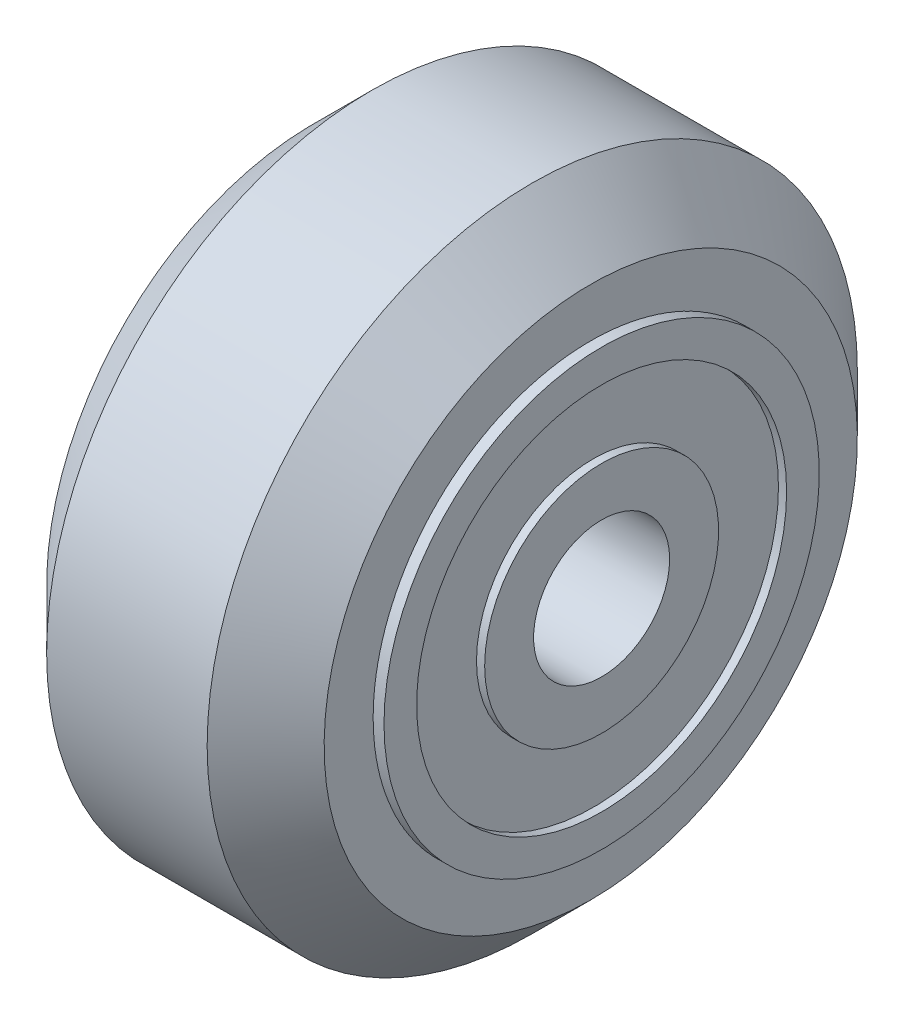
ISO-10303-21;
HEADER;
FILE_DESCRIPTION(('STEP AP214'),'2;1');
FILE_NAME('part.step','',(''),(''),'','','');
FILE_SCHEMA(('AUTOMOTIVE_DESIGN { 1 0 10303 214 1 1 1 1 }'));
ENDSEC;
DATA;
#1=APPLICATION_CONTEXT('core data for automotive mechanical design processes');
#2=APPLICATION_PROTOCOL_DEFINITION('international standard','automotive_design',2000,#1);
#3=PRODUCT_CONTEXT('',#1,'mechanical');
#4=PRODUCT('Part','Part','',(#3));
#5=PRODUCT_RELATED_PRODUCT_CATEGORY('part','',(#4));
#6=PRODUCT_DEFINITION_FORMATION('','',#4);
#7=PRODUCT_DEFINITION_CONTEXT('part definition',#1,'design');
#8=PRODUCT_DEFINITION('design','',#6,#7);
#9=PRODUCT_DEFINITION_SHAPE('','',#8);
#10=(LENGTH_UNIT() NAMED_UNIT(*) SI_UNIT(.MILLI.,.METRE.));
#11=(NAMED_UNIT(*) PLANE_ANGLE_UNIT() SI_UNIT($,.RADIAN.));
#12=(NAMED_UNIT(*) SI_UNIT($,.STERADIAN.) SOLID_ANGLE_UNIT());
#13=UNCERTAINTY_MEASURE_WITH_UNIT(LENGTH_MEASURE(1.E-05),#10,'distance_accuracy_value','');
#14=(GEOMETRIC_REPRESENTATION_CONTEXT(3) GLOBAL_UNCERTAINTY_ASSIGNED_CONTEXT((#13)) GLOBAL_UNIT_ASSIGNED_CONTEXT((#10,
#11,#12)) REPRESENTATION_CONTEXT('',''));
#15=CARTESIAN_POINT('',(0.,0.,0.));
#16=DIRECTION('',(0.,0.,1.));
#17=DIRECTION('',(1.,0.,0.));
#18=AXIS2_PLACEMENT_3D('',#15,#16,#17);
#19=CARTESIAN_POINT('',(-25.789895634528,-254.731355935514,43.4088020931475));
#20=DIRECTION('',(1.,0.,0.));
#21=DIRECTION('',(0.,0.,-1.));
#22=AXIS2_PLACEMENT_3D('',#19,#20,#21);
#23=CYLINDRICAL_SURFACE('',#22,7.00000000000003);
#24=CARTESIAN_POINT('',(-26.289895634528,-254.731355935514,43.4088020931475));
#25=DIRECTION('',(1.,0.,0.));
#26=DIRECTION('',(0.,0.,-1.));
#27=AXIS2_PLACEMENT_3D('',#24,#25,#26);
#28=CIRCLE('',#27,7.00000000000003);
#29=CARTESIAN_POINT('',(-26.289895634528,-254.731355935514,36.4088020931475));
#30=VERTEX_POINT('',#29);
#31=EDGE_CURVE('E89',#30,#30,#28,.T.);
#32=ORIENTED_EDGE('',*,*,#31,.F.);
#33=EDGE_LOOP('',(#32));
#34=FACE_BOUND('',#33,.T.);
#35=CARTESIAN_POINT('',(-25.289895634528,-254.731355935514,43.4088020931475));
#36=DIRECTION('',(1.,0.,0.));
#37=DIRECTION('',(0.,0.,-1.));
#38=AXIS2_PLACEMENT_3D('',#35,#36,#37);
#39=CIRCLE('',#38,7.00000000000003);
#40=CARTESIAN_POINT('',(-25.289895634528,-254.731355935514,36.4088020931475));
#41=VERTEX_POINT('',#40);
#42=EDGE_CURVE('E51',#41,#41,#39,.F.);
#43=ORIENTED_EDGE('',*,*,#42,.F.);
#44=EDGE_LOOP('',(#43));
#45=FACE_BOUND('',#44,.T.);
#46=ADVANCED_FACE('F48',(#34,#45),#23,.F.);
#47=CARTESIAN_POINT('',(-25.289895634528,-262.731355935514,35.4088020931475));
#48=DIRECTION('',(1.,0.,0.));
#49=DIRECTION('',(0.,0.,-1.));
#50=AXIS2_PLACEMENT_3D('',#47,#48,#49);
#51=PLANE('',#50);
#52=ORIENTED_EDGE('',*,*,#42,.T.);
#53=EDGE_LOOP('',(#52));
#54=FACE_BOUND('',#53,.T.);
#55=CARTESIAN_POINT('',(-25.289895634528,-254.731355935514,43.4088020931475));
#56=DIRECTION('',(1.,0.,0.));
#57=DIRECTION('',(0.,0.,-1.));
#58=AXIS2_PLACEMENT_3D('',#55,#56,#57);
#59=CIRCLE('',#58,8.00000000000001);
#60=CARTESIAN_POINT('',(-25.289895634528,-254.731355935514,35.4088020931475));
#61=VERTEX_POINT('',#60);
#62=EDGE_CURVE('E86',#61,#61,#59,.T.);
#63=ORIENTED_EDGE('',*,*,#62,.T.);
#64=EDGE_LOOP('',(#63));
#65=FACE_BOUND('',#64,.T.);
#66=ADVANCED_FACE('F98',(#54,#65),#51,.T.);
#67=CARTESIAN_POINT('',(-26.289895634528,-246.731355935514,35.4088020931475));
#68=DIRECTION('',(-1.,0.,0.));
#69=DIRECTION('',(0.,0.,1.));
#70=AXIS2_PLACEMENT_3D('',#67,#68,#69);
#71=PLANE('',#70);
#72=ORIENTED_EDGE('',*,*,#31,.T.);
#73=EDGE_LOOP('',(#72));
#74=FACE_BOUND('',#73,.T.);
#75=CARTESIAN_POINT('',(-26.289895634528,-254.731355935514,43.4088020931475));
#76=DIRECTION('',(1.,0.,0.));
#77=DIRECTION('',(0.,0.,-1.));
#78=AXIS2_PLACEMENT_3D('',#75,#76,#77);
#79=CIRCLE('',#78,8.00000000000001);
#80=CARTESIAN_POINT('',(-26.289895634528,-254.731355935514,35.4088020931475));
#81=VERTEX_POINT('',#80);
#82=EDGE_CURVE('E82',#81,#81,#79,.F.);
#83=ORIENTED_EDGE('',*,*,#82,.T.);
#84=EDGE_LOOP('',(#83));
#85=FACE_BOUND('',#84,.T.);
#86=ADVANCED_FACE('F106',(#74,#85),#71,.T.);
#87=CARTESIAN_POINT('',(-22.989895634528,-254.731355935514,43.4088020931475));
#88=DIRECTION('',(1.,0.,0.));
#89=DIRECTION('',(0.,0.,-1.));
#90=AXIS2_PLACEMENT_3D('',#87,#88,#89);
#91=CYLINDRICAL_SURFACE('',#90,8.00000000000001);
#92=ORIENTED_EDGE('',*,*,#62,.F.);
#93=EDGE_LOOP('',(#92));
#94=FACE_BOUND('',#93,.T.);
#95=CARTESIAN_POINT('',(-20.689895634528,-254.731355935514,43.4088020931475));
#96=DIRECTION('',(1.,0.,0.));
#97=DIRECTION('',(0.,0.,-1.));
#98=AXIS2_PLACEMENT_3D('',#95,#96,#97);
#99=CIRCLE('',#98,8.00000000000001);
#100=CARTESIAN_POINT('',(-20.689895634528,-254.731355935514,35.4088020931475));
#101=VERTEX_POINT('',#100);
#102=EDGE_CURVE('E78',#101,#101,#99,.F.);
#103=ORIENTED_EDGE('',*,*,#102,.F.);
#104=EDGE_LOOP('',(#103));
#105=FACE_BOUND('',#104,.T.);
#106=ADVANCED_FACE('F133',(#94,#105),#91,.F.);
#107=CARTESIAN_POINT('',(-28.589895634528,-254.731355935514,43.4088020931475));
#108=DIRECTION('',(1.,0.,0.));
#109=DIRECTION('',(0.,0.,-1.));
#110=AXIS2_PLACEMENT_3D('',#107,#108,#109);
#111=CYLINDRICAL_SURFACE('',#110,8.00000000000001);
#112=CARTESIAN_POINT('',(-30.889895634528,-254.731355935514,43.4088020931475));
#113=DIRECTION('',(1.,0.,0.));
#114=DIRECTION('',(0.,0.,-1.));
#115=AXIS2_PLACEMENT_3D('',#112,#113,#114);
#116=CIRCLE('',#115,8.00000000000001);
#117=CARTESIAN_POINT('',(-30.889895634528,-254.731355935514,35.4088020931475));
#118=VERTEX_POINT('',#117);
#119=EDGE_CURVE('E74',#118,#118,#116,.T.);
#120=ORIENTED_EDGE('',*,*,#119,.F.);
#121=EDGE_LOOP('',(#120));
#122=FACE_BOUND('',#121,.T.);
#123=ORIENTED_EDGE('',*,*,#82,.F.);
#124=EDGE_LOOP('',(#123));
#125=FACE_BOUND('',#124,.T.);
#126=ADVANCED_FACE('F129',(#122,#125),#111,.F.);
#127=CARTESIAN_POINT('',(-20.689895634528,-264.531355935513,33.6088020931475));
#128=DIRECTION('',(1.,0.,0.));
#129=DIRECTION('',(0.,0.,-1.));
#130=AXIS2_PLACEMENT_3D('',#127,#128,#129);
#131=PLANE('',#130);
#132=ORIENTED_EDGE('',*,*,#102,.T.);
#133=EDGE_LOOP('',(#132));
#134=FACE_BOUND('',#133,.T.);
#135=CARTESIAN_POINT('',(-20.6898956345281,-254.731355935513,43.4088020931474));
#136=DIRECTION('',(-1.,0.,0.));
#137=DIRECTION('',(0.,-1.,0.));
#138=AXIS2_PLACEMENT_3D('',#135,#136,#137);
#139=CIRCLE('',#138,9.79999999999999);
#140=CARTESIAN_POINT('',(-20.689895634528,-264.531355935513,43.4088020931474));
#141=VERTEX_POINT('',#140);
#142=EDGE_CURVE('E70',#141,#141,#139,.T.);
#143=ORIENTED_EDGE('',*,*,#142,.F.);
#144=EDGE_LOOP('',(#143));
#145=FACE_BOUND('',#144,.T.);
#146=ADVANCED_FACE('F125',(#134,#145),#131,.T.);
#147=CARTESIAN_POINT('',(-30.889895634528,-244.931355935514,33.6088020931475));
#148=DIRECTION('',(-1.,0.,0.));
#149=DIRECTION('',(0.,0.,1.));
#150=AXIS2_PLACEMENT_3D('',#147,#148,#149);
#151=PLANE('',#150);
#152=ORIENTED_EDGE('',*,*,#119,.T.);
#153=EDGE_LOOP('',(#152));
#154=FACE_BOUND('',#153,.T.);
#155=CARTESIAN_POINT('',(-30.8898956345279,-254.731355935514,43.4088020931471));
#156=DIRECTION('',(1.,0.,0.));
#157=DIRECTION('',(0.,0.,-1.));
#158=AXIS2_PLACEMENT_3D('',#155,#156,#157);
#159=CIRCLE('',#158,9.80000000000014);
#160=CARTESIAN_POINT('',(-30.8898956345276,-254.731355935514,33.6088020931469));
#161=VERTEX_POINT('',#160);
#162=EDGE_CURVE('E62',#161,#161,#159,.T.);
#163=ORIENTED_EDGE('',*,*,#162,.F.);
#164=EDGE_LOOP('',(#163));
#165=FACE_BOUND('',#164,.T.);
#166=ADVANCED_FACE('F121',(#154,#165),#151,.T.);
#167=CARTESIAN_POINT('',(-22.8398956345286,-254.731355935513,43.4088020931474));
#168=DIRECTION('',(-1.,0.,0.));
#169=DIRECTION('',(0.,-1.,0.));
#170=AXIS2_PLACEMENT_3D('',#167,#168,#169);
#171=CONICAL_SURFACE('',#170,11.9500000000005,0.785398163397453);
#172=ORIENTED_EDGE('',*,*,#142,.T.);
#173=EDGE_LOOP('',(#172));
#174=FACE_BOUND('',#173,.T.);
#175=CARTESIAN_POINT('',(-22.839895634528,-254.731355935514,43.4088020931475));
#176=DIRECTION('',(-1.,0.,0.));
#177=DIRECTION('',(0.,0.,1.));
#178=AXIS2_PLACEMENT_3D('',#175,#176,#177);
#179=CIRCLE('',#178,11.95);
#180=CARTESIAN_POINT('',(-22.839895634528,-254.731355935514,55.3588020931475));
#181=VERTEX_POINT('',#180);
#182=EDGE_CURVE('E11',#181,#181,#179,.T.);
#183=ORIENTED_EDGE('',*,*,#182,.F.);
#184=EDGE_LOOP('',(#183));
#185=FACE_BOUND('',#184,.T.);
#186=ADVANCED_FACE('F114',(#174,#185),#171,.T.);
#187=CARTESIAN_POINT('',(-28.7398956345277,-254.731355935514,43.4088020931471));
#188=DIRECTION('',(1.,0.,0.));
#189=DIRECTION('',(0.,0.,-1.));
#190=AXIS2_PLACEMENT_3D('',#187,#188,#189);
#191=CONICAL_SURFACE('',#190,11.9500000000005,0.785398163397481);
#192=CARTESIAN_POINT('',(-28.739895634528,-254.731355935514,43.4088020931475));
#193=DIRECTION('',(-1.,0.,0.));
#194=DIRECTION('',(0.,0.,1.));
#195=AXIS2_PLACEMENT_3D('',#192,#193,#194);
#196=CIRCLE('',#195,11.95);
#197=CARTESIAN_POINT('',(-28.739895634528,-254.731355935514,55.3588020931475));
#198=VERTEX_POINT('',#197);
#199=EDGE_CURVE('E56',#198,#198,#196,.F.);
#200=ORIENTED_EDGE('',*,*,#199,.F.);
#201=EDGE_LOOP('',(#200));
#202=FACE_BOUND('',#201,.T.);
#203=ORIENTED_EDGE('',*,*,#162,.T.);
#204=EDGE_LOOP('',(#203));
#205=FACE_BOUND('',#204,.T.);
#206=ADVANCED_FACE('F109',(#202,#205),#191,.T.);
#207=CARTESIAN_POINT('',(-28.739895634528,-254.731355935514,43.4088020931475));
#208=DIRECTION('',(-1.,0.,0.));
#209=DIRECTION('',(0.,0.,1.));
#210=AXIS2_PLACEMENT_3D('',#207,#208,#209);
#211=CYLINDRICAL_SURFACE('',#210,11.95);
#212=ORIENTED_EDGE('',*,*,#182,.T.);
#213=EDGE_LOOP('',(#212));
#214=FACE_BOUND('',#213,.T.);
#215=ORIENTED_EDGE('',*,*,#199,.T.);
#216=EDGE_LOOP('',(#215));
#217=FACE_BOUND('',#216,.T.);
#218=ADVANCED_FACE('F107',(#214,#217),#211,.T.);
#219=CLOSED_SHELL('',(#46,#66,#86,#106,#126,#146,#166,#186,#206,#218));
#220=MANIFOLD_SOLID_BREP('B2',#219);
#221=CARTESIAN_POINT('',(-22.789895634528,-254.731355935513,43.4088020931474));
#222=DIRECTION('',(1.,0.,0.));
#223=DIRECTION('',(0.,0.,-1.));
#224=AXIS2_PLACEMENT_3D('',#221,#222,#223);
#225=CYLINDRICAL_SURFACE('',#224,2.50000000000023);
#226=CARTESIAN_POINT('',(-25.289895634528,-254.731355935513,43.4088020931474));
#227=DIRECTION('',(1.,0.,0.));
#228=DIRECTION('',(0.,0.,-1.));
#229=AXIS2_PLACEMENT_3D('',#226,#227,#228);
#230=CIRCLE('',#229,2.50000000000023);
#231=CARTESIAN_POINT('',(-25.289895634528,-254.731355935513,40.9088020931471));
#232=VERTEX_POINT('',#231);
#233=EDGE_CURVE('E222',#232,#232,#230,.T.);
#234=ORIENTED_EDGE('',*,*,#233,.F.);
#235=EDGE_LOOP('',(#234));
#236=FACE_BOUND('',#235,.T.);
#237=CARTESIAN_POINT('',(-20.289895634528,-254.731355935513,43.4088020931474));
#238=DIRECTION('',(1.,0.,0.));
#239=DIRECTION('',(0.,0.,-1.));
#240=AXIS2_PLACEMENT_3D('',#237,#238,#239);
#241=CIRCLE('',#240,2.50000000000023);
#242=CARTESIAN_POINT('',(-20.289895634528,-254.731355935513,40.9088020931471));
#243=VERTEX_POINT('',#242);
#244=EDGE_CURVE('E256',#243,#243,#241,.F.);
#245=ORIENTED_EDGE('',*,*,#244,.F.);
#246=EDGE_LOOP('',(#245));
#247=FACE_BOUND('',#246,.T.);
#248=ADVANCED_FACE('F219',(#236,#247),#225,.F.);
#249=CARTESIAN_POINT('',(-25.289895634528,-258.39605405525,38.5559691379341));
#250=DIRECTION('',(-1.,0.,0.));
#251=DIRECTION('',(0.,0.,1.));
#252=AXIS2_PLACEMENT_3D('',#249,#250,#251);
#253=PLANE('',#252);
#254=ORIENTED_EDGE('',*,*,#233,.T.);
#255=EDGE_LOOP('',(#254));
#256=FACE_BOUND('',#255,.T.);
#257=CARTESIAN_POINT('',(-25.289895634528,-254.731355935514,43.4088020931476));
#258=DIRECTION('',(-1.,0.,0.));
#259=DIRECTION('',(0.,0.,1.));
#260=AXIS2_PLACEMENT_3D('',#257,#258,#259);
#261=CIRCLE('',#260,4.29999999999963);
#262=CARTESIAN_POINT('',(-25.289895634528,-254.731355935514,47.7088020931472));
#263=VERTEX_POINT('',#262);
#264=EDGE_CURVE('E254',#263,#263,#261,.F.);
#265=ORIENTED_EDGE('',*,*,#264,.F.);
#266=EDGE_LOOP('',(#265));
#267=FACE_BOUND('',#266,.T.);
#268=ADVANCED_FACE('F263',(#256,#267),#253,.T.);
#269=CARTESIAN_POINT('',(-20.289895634528,-259.584188890728,47.0735002128833));
#270=DIRECTION('',(1.,0.,0.));
#271=DIRECTION('',(0.,0.,-1.));
#272=AXIS2_PLACEMENT_3D('',#269,#270,#271);
#273=PLANE('',#272);
#274=ORIENTED_EDGE('',*,*,#244,.T.);
#275=EDGE_LOOP('',(#274));
#276=FACE_BOUND('',#275,.T.);
#277=CARTESIAN_POINT('',(-20.289895634528,-254.731355935514,43.4088020931476));
#278=DIRECTION('',(-1.,0.,0.));
#279=DIRECTION('',(0.,0.,1.));
#280=AXIS2_PLACEMENT_3D('',#277,#278,#279);
#281=CIRCLE('',#280,4.29999999999963);
#282=CARTESIAN_POINT('',(-20.289895634528,-254.731355935514,47.7088020931472));
#283=VERTEX_POINT('',#282);
#284=EDGE_CURVE('E251',#283,#283,#281,.T.);
#285=ORIENTED_EDGE('',*,*,#284,.F.);
#286=EDGE_LOOP('',(#285));
#287=FACE_BOUND('',#286,.T.);
#288=ADVANCED_FACE('F271',(#276,#287),#273,.T.);
#289=CARTESIAN_POINT('',(-25.289895634528,-254.731355935514,43.4088020931476));
#290=DIRECTION('',(-1.,0.,0.));
#291=DIRECTION('',(0.,0.,1.));
#292=AXIS2_PLACEMENT_3D('',#289,#290,#291);
#293=CYLINDRICAL_SURFACE('',#292,4.29999999999963);
#294=CARTESIAN_POINT('',(-24.989895634528,-254.731355935514,43.4088020931476));
#295=DIRECTION('',(-1.,0.,0.));
#296=DIRECTION('',(0.,0.,1.));
#297=AXIS2_PLACEMENT_3D('',#294,#295,#296);
#298=CIRCLE('',#297,4.29999999999963);
#299=CARTESIAN_POINT('',(-24.989895634528,-254.731355935514,47.7088020931472));
#300=VERTEX_POINT('',#299);
#301=EDGE_CURVE('E248',#300,#300,#298,.F.);
#302=ORIENTED_EDGE('',*,*,#301,.F.);
#303=EDGE_LOOP('',(#302));
#304=FACE_BOUND('',#303,.T.);
#305=ORIENTED_EDGE('',*,*,#264,.T.);
#306=EDGE_LOOP('',(#305));
#307=FACE_BOUND('',#306,.T.);
#308=ADVANCED_FACE('F306',(#304,#307),#293,.T.);
#309=CARTESIAN_POINT('',(-20.589895634528,-254.731355935514,43.4088020931476));
#310=DIRECTION('',(-1.,0.,0.));
#311=DIRECTION('',(0.,0.,1.));
#312=AXIS2_PLACEMENT_3D('',#309,#310,#311);
#313=CYLINDRICAL_SURFACE('',#312,4.29999999999963);
#314=ORIENTED_EDGE('',*,*,#284,.T.);
#315=EDGE_LOOP('',(#314));
#316=FACE_BOUND('',#315,.T.);
#317=CARTESIAN_POINT('',(-20.589895634528,-254.731355935514,43.4088020931476));
#318=DIRECTION('',(-1.,0.,0.));
#319=DIRECTION('',(0.,0.,1.));
#320=AXIS2_PLACEMENT_3D('',#317,#318,#319);
#321=CIRCLE('',#320,4.29999999999963);
#322=CARTESIAN_POINT('',(-20.589895634528,-254.731355935514,47.7088020931472));
#323=VERTEX_POINT('',#322);
#324=EDGE_CURVE('E245',#323,#323,#321,.T.);
#325=ORIENTED_EDGE('',*,*,#324,.F.);
#326=EDGE_LOOP('',(#325));
#327=FACE_BOUND('',#326,.T.);
#328=ADVANCED_FACE('F302',(#316,#327),#313,.T.);
#329=CARTESIAN_POINT('',(-24.989895634528,-260.526692496957,35.7345546290891));
#330=DIRECTION('',(-1.,0.,0.));
#331=DIRECTION('',(0.,0.,1.));
#332=AXIS2_PLACEMENT_3D('',#329,#330,#331);
#333=PLANE('',#332);
#334=ORIENTED_EDGE('',*,*,#301,.T.);
#335=EDGE_LOOP('',(#334));
#336=FACE_BOUND('',#335,.T.);
#337=CARTESIAN_POINT('',(-24.989895634528,-254.731355935514,43.4088020931471));
#338=DIRECTION('',(1.,0.,0.));
#339=DIRECTION('',(0.,0.,-1.));
#340=AXIS2_PLACEMENT_3D('',#337,#338,#339);
#341=CIRCLE('',#340,6.80000000000033);
#342=CARTESIAN_POINT('',(-24.989895634528,-254.731355935514,36.6088020931467));
#343=VERTEX_POINT('',#342);
#344=EDGE_CURVE('E242',#343,#343,#341,.F.);
#345=ORIENTED_EDGE('',*,*,#344,.T.);
#346=EDGE_LOOP('',(#345));
#347=FACE_BOUND('',#346,.T.);
#348=ADVANCED_FACE('F298',(#336,#347),#333,.T.);
#349=CARTESIAN_POINT('',(-20.589895634528,-262.405603399573,49.2041386545901));
#350=DIRECTION('',(1.,0.,0.));
#351=DIRECTION('',(0.,0.,-1.));
#352=AXIS2_PLACEMENT_3D('',#349,#350,#351);
#353=PLANE('',#352);
#354=ORIENTED_EDGE('',*,*,#324,.T.);
#355=EDGE_LOOP('',(#354));
#356=FACE_BOUND('',#355,.T.);
#357=CARTESIAN_POINT('',(-20.589895634528,-254.731355935514,43.4088020931473));
#358=DIRECTION('',(1.,0.,0.));
#359=DIRECTION('',(0.,0.,-1.));
#360=AXIS2_PLACEMENT_3D('',#357,#358,#359);
#361=CIRCLE('',#360,6.80000000000021);
#362=CARTESIAN_POINT('',(-20.589895634528,-254.731355935514,36.6088020931471));
#363=VERTEX_POINT('',#362);
#364=EDGE_CURVE('E239',#363,#363,#361,.T.);
#365=ORIENTED_EDGE('',*,*,#364,.T.);
#366=EDGE_LOOP('',(#365));
#367=FACE_BOUND('',#366,.T.);
#368=ADVANCED_FACE('F294',(#356,#367),#353,.T.);
#369=CARTESIAN_POINT('',(-25.139895634528,-254.731355935514,43.4088020931471));
#370=DIRECTION('',(1.,0.,0.));
#371=DIRECTION('',(0.,0.,-1.));
#372=AXIS2_PLACEMENT_3D('',#369,#370,#371);
#373=CYLINDRICAL_SURFACE('',#372,6.80000000000033);
#374=CARTESIAN_POINT('',(-25.289895634528,-254.731355935514,43.4088020931471));
#375=DIRECTION('',(1.,0.,0.));
#376=DIRECTION('',(0.,0.,-1.));
#377=AXIS2_PLACEMENT_3D('',#374,#375,#376);
#378=CIRCLE('',#377,6.80000000000033);
#379=CARTESIAN_POINT('',(-25.289895634528,-254.731355935514,36.6088020931467));
#380=VERTEX_POINT('',#379);
#381=EDGE_CURVE('E236',#380,#380,#378,.T.);
#382=ORIENTED_EDGE('',*,*,#381,.F.);
#383=EDGE_LOOP('',(#382));
#384=FACE_BOUND('',#383,.T.);
#385=ORIENTED_EDGE('',*,*,#344,.F.);
#386=EDGE_LOOP('',(#385));
#387=FACE_BOUND('',#386,.T.);
#388=ADVANCED_FACE('F290',(#384,#387),#373,.F.);
#389=CARTESIAN_POINT('',(-20.439895634528,-254.731355935514,43.4088020931473));
#390=DIRECTION('',(1.,0.,0.));
#391=DIRECTION('',(0.,0.,-1.));
#392=AXIS2_PLACEMENT_3D('',#389,#390,#391);
#393=CYLINDRICAL_SURFACE('',#392,6.80000000000021);
#394=ORIENTED_EDGE('',*,*,#364,.F.);
#395=EDGE_LOOP('',(#394));
#396=FACE_BOUND('',#395,.T.);
#397=CARTESIAN_POINT('',(-20.289895634528,-254.731355935514,43.4088020931473));
#398=DIRECTION('',(1.,0.,0.));
#399=DIRECTION('',(0.,0.,-1.));
#400=AXIS2_PLACEMENT_3D('',#397,#398,#399);
#401=CIRCLE('',#400,6.80000000000021);
#402=CARTESIAN_POINT('',(-20.289895634528,-254.731355935514,36.6088020931471));
#403=VERTEX_POINT('',#402);
#404=EDGE_CURVE('E231',#403,#403,#401,.F.);
#405=ORIENTED_EDGE('',*,*,#404,.F.);
#406=EDGE_LOOP('',(#405));
#407=FACE_BOUND('',#406,.T.);
#408=ADVANCED_FACE('F286',(#396,#407),#393,.F.);
#409=CARTESIAN_POINT('',(-25.289895634528,-261.549398948976,34.3802756648435));
#410=DIRECTION('',(-1.,0.,0.));
#411=DIRECTION('',(0.,0.,1.));
#412=AXIS2_PLACEMENT_3D('',#409,#410,#411);
#413=PLANE('',#412);
#414=ORIENTED_EDGE('',*,*,#381,.T.);
#415=EDGE_LOOP('',(#414));
#416=FACE_BOUND('',#415,.T.);
#417=CARTESIAN_POINT('',(-25.289895634528,-254.731355935514,43.4088020931474));
#418=DIRECTION('',(-1.,0.,0.));
#419=DIRECTION('',(0.,0.,1.));
#420=AXIS2_PLACEMENT_3D('',#417,#418,#419);
#421=CIRCLE('',#420,8.00000000000002);
#422=CARTESIAN_POINT('',(-25.289895634528,-254.731355935514,51.4088020931474));
#423=VERTEX_POINT('',#422);
#424=EDGE_CURVE('E226',#423,#423,#421,.F.);
#425=ORIENTED_EDGE('',*,*,#424,.F.);
#426=EDGE_LOOP('',(#425));
#427=FACE_BOUND('',#426,.T.);
#428=ADVANCED_FACE('F279',(#416,#427),#413,.T.);
#429=CARTESIAN_POINT('',(-20.289895634528,-263.759882363818,50.2268451066094));
#430=DIRECTION('',(1.,0.,0.));
#431=DIRECTION('',(0.,0.,-1.));
#432=AXIS2_PLACEMENT_3D('',#429,#430,#431);
#433=PLANE('',#432);
#434=ORIENTED_EDGE('',*,*,#404,.T.);
#435=EDGE_LOOP('',(#434));
#436=FACE_BOUND('',#435,.T.);
#437=CARTESIAN_POINT('',(-20.289895634528,-254.731355935514,43.4088020931474));
#438=DIRECTION('',(-1.,0.,0.));
#439=DIRECTION('',(0.,0.,1.));
#440=AXIS2_PLACEMENT_3D('',#437,#438,#439);
#441=CIRCLE('',#440,8.00000000000002);
#442=CARTESIAN_POINT('',(-20.289895634528,-254.731355935514,51.4088020931474));
#443=VERTEX_POINT('',#442);
#444=EDGE_CURVE('E47',#443,#443,#441,.T.);
#445=ORIENTED_EDGE('',*,*,#444,.F.);
#446=EDGE_LOOP('',(#445));
#447=FACE_BOUND('',#446,.T.);
#448=ADVANCED_FACE('F274',(#436,#447),#433,.T.);
#449=CARTESIAN_POINT('',(-25.289895634528,-254.731355935514,43.4088020931474));
#450=DIRECTION('',(-1.,0.,0.));
#451=DIRECTION('',(0.,0.,1.));
#452=AXIS2_PLACEMENT_3D('',#449,#450,#451);
#453=CYLINDRICAL_SURFACE('',#452,8.00000000000002);
#454=ORIENTED_EDGE('',*,*,#444,.T.);
#455=EDGE_LOOP('',(#454));
#456=FACE_BOUND('',#455,.T.);
#457=ORIENTED_EDGE('',*,*,#424,.T.);
#458=EDGE_LOOP('',(#457));
#459=FACE_BOUND('',#458,.T.);
#460=ADVANCED_FACE('F272',(#456,#459),#453,.T.);
#461=CLOSED_SHELL('',(#248,#268,#288,#308,#328,#348,#368,#388,#408,#428,#448,#460));
#462=MANIFOLD_SOLID_BREP('B6',#461);
#463=CARTESIAN_POINT('',(-28.789895634528,-254.731355935514,43.4088020931475));
#464=DIRECTION('',(-1.,0.,0.));
#465=DIRECTION('',(0.,0.,1.));
#466=AXIS2_PLACEMENT_3D('',#463,#464,#465);
#467=CYLINDRICAL_SURFACE('',#466,2.50000000000033);
#468=CARTESIAN_POINT('',(-26.289895634528,-254.731355935514,43.4088020931475));
#469=DIRECTION('',(-1.,0.,0.));
#470=DIRECTION('',(0.,0.,1.));
#471=AXIS2_PLACEMENT_3D('',#468,#469,#470);
#472=CIRCLE('',#471,2.50000000000033);
#473=CARTESIAN_POINT('',(-26.289895634528,-254.731355935514,45.9088020931478));
#474=VERTEX_POINT('',#473);
#475=EDGE_CURVE('E404',#474,#474,#472,.T.);
#476=ORIENTED_EDGE('',*,*,#475,.F.);
#477=EDGE_LOOP('',(#476));
#478=FACE_BOUND('',#477,.T.);
#479=CARTESIAN_POINT('',(-31.289895634528,-254.731355935514,43.4088020931475));
#480=DIRECTION('',(-1.,0.,0.));
#481=DIRECTION('',(0.,0.,1.));
#482=AXIS2_PLACEMENT_3D('',#479,#480,#481);
#483=CIRCLE('',#482,2.50000000000033);
#484=CARTESIAN_POINT('',(-31.289895634528,-254.731355935514,45.9088020931478));
#485=VERTEX_POINT('',#484);
#486=EDGE_CURVE('E438',#485,#485,#483,.F.);
#487=ORIENTED_EDGE('',*,*,#486,.F.);
#488=EDGE_LOOP('',(#487));
#489=FACE_BOUND('',#488,.T.);
#490=ADVANCED_FACE('F401',(#478,#489),#467,.F.);
#491=CARTESIAN_POINT('',(-26.289895634528,-252.894491151821,49.2058640875054));
#492=DIRECTION('',(1.,0.,0.));
#493=DIRECTION('',(0.,0.,-1.));
#494=AXIS2_PLACEMENT_3D('',#491,#492,#493);
#495=PLANE('',#494);
#496=ORIENTED_EDGE('',*,*,#475,.T.);
#497=EDGE_LOOP('',(#496));
#498=FACE_BOUND('',#497,.T.);
#499=CARTESIAN_POINT('',(-26.289895634528,-254.731355935514,43.4088020931478));
#500=DIRECTION('',(1.,0.,0.));
#501=DIRECTION('',(0.,0.,-1.));
#502=AXIS2_PLACEMENT_3D('',#499,#500,#501);
#503=CIRCLE('',#502,4.29999999999979);
#504=CARTESIAN_POINT('',(-26.289895634528,-254.731355935514,39.108802093148));
#505=VERTEX_POINT('',#504);
#506=EDGE_CURVE('E436',#505,#505,#503,.F.);
#507=ORIENTED_EDGE('',*,*,#506,.F.);
#508=EDGE_LOOP('',(#507));
#509=FACE_BOUND('',#508,.T.);
#510=ADVANCED_FACE('F445',(#498,#509),#495,.T.);
#511=CARTESIAN_POINT('',(-31.289895634528,-260.528417929872,45.2456668768406));
#512=DIRECTION('',(-1.,0.,0.));
#513=DIRECTION('',(0.,0.,1.));
#514=AXIS2_PLACEMENT_3D('',#511,#512,#513);
#515=PLANE('',#514);
#516=ORIENTED_EDGE('',*,*,#486,.T.);
#517=EDGE_LOOP('',(#516));
#518=FACE_BOUND('',#517,.T.);
#519=CARTESIAN_POINT('',(-31.289895634528,-254.731355935514,43.4088020931479));
#520=DIRECTION('',(1.,0.,0.));
#521=DIRECTION('',(0.,0.,-1.));
#522=AXIS2_PLACEMENT_3D('',#519,#520,#521);
#523=CIRCLE('',#522,4.29999999999978);
#524=CARTESIAN_POINT('',(-31.289895634528,-254.731355935514,39.1088020931481));
#525=VERTEX_POINT('',#524);
#526=EDGE_CURVE('E433',#525,#525,#523,.T.);
#527=ORIENTED_EDGE('',*,*,#526,.F.);
#528=EDGE_LOOP('',(#527));
#529=FACE_BOUND('',#528,.T.);
#530=ADVANCED_FACE('F453',(#518,#529),#515,.T.);
#531=CARTESIAN_POINT('',(-26.289895634528,-254.731355935514,43.4088020931478));
#532=DIRECTION('',(1.,0.,0.));
#533=DIRECTION('',(0.,0.,-1.));
#534=AXIS2_PLACEMENT_3D('',#531,#532,#533);
#535=CYLINDRICAL_SURFACE('',#534,4.29999999999979);
#536=CARTESIAN_POINT('',(-26.589895634528,-254.731355935514,43.4088020931478));
#537=DIRECTION('',(1.,0.,0.));
#538=DIRECTION('',(0.,0.,-1.));
#539=AXIS2_PLACEMENT_3D('',#536,#537,#538);
#540=CIRCLE('',#539,4.29999999999979);
#541=CARTESIAN_POINT('',(-26.589895634528,-254.731355935514,39.108802093148));
#542=VERTEX_POINT('',#541);
#543=EDGE_CURVE('E430',#542,#542,#540,.F.);
#544=ORIENTED_EDGE('',*,*,#543,.F.);
#545=EDGE_LOOP('',(#544));
#546=FACE_BOUND('',#545,.T.);
#547=ORIENTED_EDGE('',*,*,#506,.T.);
#548=EDGE_LOOP('',(#547));
#549=FACE_BOUND('',#548,.T.);
#550=ADVANCED_FACE('F488',(#546,#549),#535,.T.);
#551=CARTESIAN_POINT('',(-30.989895634528,-254.731355935514,43.4088020931479));
#552=DIRECTION('',(1.,0.,0.));
#553=DIRECTION('',(0.,0.,-1.));
#554=AXIS2_PLACEMENT_3D('',#551,#552,#553);
#555=CYLINDRICAL_SURFACE('',#554,4.29999999999978);
#556=ORIENTED_EDGE('',*,*,#526,.T.);
#557=EDGE_LOOP('',(#556));
#558=FACE_BOUND('',#557,.T.);
#559=CARTESIAN_POINT('',(-30.989895634528,-254.731355935514,43.4088020931479));
#560=DIRECTION('',(1.,0.,0.));
#561=DIRECTION('',(0.,0.,-1.));
#562=AXIS2_PLACEMENT_3D('',#559,#560,#561);
#563=CIRCLE('',#562,4.29999999999978);
#564=CARTESIAN_POINT('',(-30.989895634528,-254.731355935514,39.1088020931481));
#565=VERTEX_POINT('',#564);
#566=EDGE_CURVE('E427',#565,#565,#563,.T.);
#567=ORIENTED_EDGE('',*,*,#566,.F.);
#568=EDGE_LOOP('',(#567));
#569=FACE_BOUND('',#568,.T.);
#570=ADVANCED_FACE('F484',(#558,#569),#555,.T.);
#571=CARTESIAN_POINT('',(-26.589895634528,-251.826546510139,52.5762489679461));
#572=DIRECTION('',(1.,0.,0.));
#573=DIRECTION('',(0.,0.,-1.));
#574=AXIS2_PLACEMENT_3D('',#571,#572,#573);
#575=PLANE('',#574);
#576=ORIENTED_EDGE('',*,*,#543,.T.);
#577=EDGE_LOOP('',(#576));
#578=FACE_BOUND('',#577,.T.);
#579=CARTESIAN_POINT('',(-26.589895634528,-254.731355935514,43.4088020931477));
#580=DIRECTION('',(-1.,0.,0.));
#581=DIRECTION('',(0.,0.,1.));
#582=AXIS2_PLACEMENT_3D('',#579,#580,#581);
#583=CIRCLE('',#582,6.79999999999971);
#584=CARTESIAN_POINT('',(-26.589895634528,-254.731355935514,50.2088020931474));
#585=VERTEX_POINT('',#584);
#586=EDGE_CURVE('E424',#585,#585,#583,.F.);
#587=ORIENTED_EDGE('',*,*,#586,.T.);
#588=EDGE_LOOP('',(#587));
#589=FACE_BOUND('',#588,.T.);
#590=ADVANCED_FACE('F480',(#578,#589),#575,.T.);
#591=CARTESIAN_POINT('',(-30.989895634528,-263.898802810313,46.3136115185226));
#592=DIRECTION('',(-1.,0.,0.));
#593=DIRECTION('',(0.,0.,1.));
#594=AXIS2_PLACEMENT_3D('',#591,#592,#593);
#595=PLANE('',#594);
#596=ORIENTED_EDGE('',*,*,#566,.T.);
#597=EDGE_LOOP('',(#596));
#598=FACE_BOUND('',#597,.T.);
#599=CARTESIAN_POINT('',(-30.989895634528,-254.731355935514,43.4088020931477));
#600=DIRECTION('',(-1.,0.,0.));
#601=DIRECTION('',(0.,0.,1.));
#602=AXIS2_PLACEMENT_3D('',#599,#600,#601);
#603=CIRCLE('',#602,6.79999999999974);
#604=CARTESIAN_POINT('',(-30.989895634528,-254.731355935514,50.2088020931474));
#605=VERTEX_POINT('',#604);
#606=EDGE_CURVE('E421',#605,#605,#603,.T.);
#607=ORIENTED_EDGE('',*,*,#606,.T.);
#608=EDGE_LOOP('',(#607));
#609=FACE_BOUND('',#608,.T.);
#610=ADVANCED_FACE('F476',(#598,#609),#595,.T.);
#611=CARTESIAN_POINT('',(-26.439895634528,-254.731355935514,43.4088020931477));
#612=DIRECTION('',(-1.,0.,0.));
#613=DIRECTION('',(0.,0.,1.));
#614=AXIS2_PLACEMENT_3D('',#611,#612,#613);
#615=CYLINDRICAL_SURFACE('',#614,6.79999999999971);
#616=CARTESIAN_POINT('',(-26.289895634528,-254.731355935514,43.4088020931477));
#617=DIRECTION('',(-1.,0.,0.));
#618=DIRECTION('',(0.,0.,1.));
#619=AXIS2_PLACEMENT_3D('',#616,#617,#618);
#620=CIRCLE('',#619,6.79999999999971);
#621=CARTESIAN_POINT('',(-26.289895634528,-254.731355935514,50.2088020931474));
#622=VERTEX_POINT('',#621);
#623=EDGE_CURVE('E418',#622,#622,#620,.T.);
#624=ORIENTED_EDGE('',*,*,#623,.F.);
#625=EDGE_LOOP('',(#624));
#626=FACE_BOUND('',#625,.T.);
#627=ORIENTED_EDGE('',*,*,#586,.F.);
#628=EDGE_LOOP('',(#627));
#629=FACE_BOUND('',#628,.T.);
#630=ADVANCED_FACE('F472',(#626,#629),#615,.F.);
#631=CARTESIAN_POINT('',(-31.139895634528,-254.731355935514,43.4088020931477));
#632=DIRECTION('',(-1.,0.,0.));
#633=DIRECTION('',(0.,0.,1.));
#634=AXIS2_PLACEMENT_3D('',#631,#632,#633);
#635=CYLINDRICAL_SURFACE('',#634,6.79999999999974);
#636=ORIENTED_EDGE('',*,*,#606,.F.);
#637=EDGE_LOOP('',(#636));
#638=FACE_BOUND('',#637,.T.);
#639=CARTESIAN_POINT('',(-31.289895634528,-254.731355935514,43.4088020931477));
#640=DIRECTION('',(-1.,0.,0.));
#641=DIRECTION('',(0.,0.,1.));
#642=AXIS2_PLACEMENT_3D('',#639,#640,#641);
#643=CIRCLE('',#642,6.79999999999974);
#644=CARTESIAN_POINT('',(-31.289895634528,-254.731355935514,50.2088020931474));
#645=VERTEX_POINT('',#644);
#646=EDGE_CURVE('E413',#645,#645,#643,.F.);
#647=ORIENTED_EDGE('',*,*,#646,.F.);
#648=EDGE_LOOP('',(#647));
#649=FACE_BOUND('',#648,.T.);
#650=ADVANCED_FACE('F468',(#638,#649),#635,.F.);
#651=CARTESIAN_POINT('',(-26.289895634528,-251.313933082132,54.1940337105574));
#652=DIRECTION('',(1.,0.,0.));
#653=DIRECTION('',(0.,0.,-1.));
#654=AXIS2_PLACEMENT_3D('',#651,#652,#653);
#655=PLANE('',#654);
#656=ORIENTED_EDGE('',*,*,#623,.T.);
#657=EDGE_LOOP('',(#656));
#658=FACE_BOUND('',#657,.T.);
#659=CARTESIAN_POINT('',(-26.289895634528,-254.731355935514,43.4088020931481));
#660=DIRECTION('',(1.,0.,0.));
#661=DIRECTION('',(0.,0.,-1.));
#662=AXIS2_PLACEMENT_3D('',#659,#660,#661);
#663=CIRCLE('',#662,7.99999999999945);
#664=CARTESIAN_POINT('',(-26.289895634528,-254.731355935514,35.4088020931486));
#665=VERTEX_POINT('',#664);
#666=EDGE_CURVE('E408',#665,#665,#663,.F.);
#667=ORIENTED_EDGE('',*,*,#666,.F.);
#668=EDGE_LOOP('',(#667));
#669=FACE_BOUND('',#668,.T.);
#670=ADVANCED_FACE('F461',(#658,#669),#655,.T.);
#671=CARTESIAN_POINT('',(-31.289895634528,-265.516587552924,46.8262249465301));
#672=DIRECTION('',(-1.,0.,0.));
#673=DIRECTION('',(0.,0.,1.));
#674=AXIS2_PLACEMENT_3D('',#671,#672,#673);
#675=PLANE('',#674);
#676=ORIENTED_EDGE('',*,*,#646,.T.);
#677=EDGE_LOOP('',(#676));
#678=FACE_BOUND('',#677,.T.);
#679=CARTESIAN_POINT('',(-31.289895634528,-254.731355935514,43.4088020931481));
#680=DIRECTION('',(1.,0.,0.));
#681=DIRECTION('',(0.,0.,-1.));
#682=AXIS2_PLACEMENT_3D('',#679,#680,#681);
#683=CIRCLE('',#682,7.99999999999945);
#684=CARTESIAN_POINT('',(-31.289895634528,-254.731355935514,35.4088020931486));
#685=VERTEX_POINT('',#684);
#686=EDGE_CURVE('E218',#685,#685,#683,.T.);
#687=ORIENTED_EDGE('',*,*,#686,.F.);
#688=EDGE_LOOP('',(#687));
#689=FACE_BOUND('',#688,.T.);
#690=ADVANCED_FACE('F456',(#678,#689),#675,.T.);
#691=CARTESIAN_POINT('',(-26.289895634528,-254.731355935514,43.4088020931481));
#692=DIRECTION('',(1.,0.,0.));
#693=DIRECTION('',(0.,0.,-1.));
#694=AXIS2_PLACEMENT_3D('',#691,#692,#693);
#695=CYLINDRICAL_SURFACE('',#694,7.99999999999945);
#696=ORIENTED_EDGE('',*,*,#686,.T.);
#697=EDGE_LOOP('',(#696));
#698=FACE_BOUND('',#697,.T.);
#699=ORIENTED_EDGE('',*,*,#666,.T.);
#700=EDGE_LOOP('',(#699));
#701=FACE_BOUND('',#700,.T.);
#702=ADVANCED_FACE('F454',(#698,#701),#695,.T.);
#703=CLOSED_SHELL('',(#490,#510,#530,#550,#570,#590,#610,#630,#650,#670,#690,#702));
#704=MANIFOLD_SOLID_BREP('B42',#703);
#705=ADVANCED_BREP_SHAPE_REPRESENTATION('',(#18,#220,#462,#704),#14);
#706=SHAPE_DEFINITION_REPRESENTATION(#9,#705);
ENDSEC;
END-ISO-10303-21;
